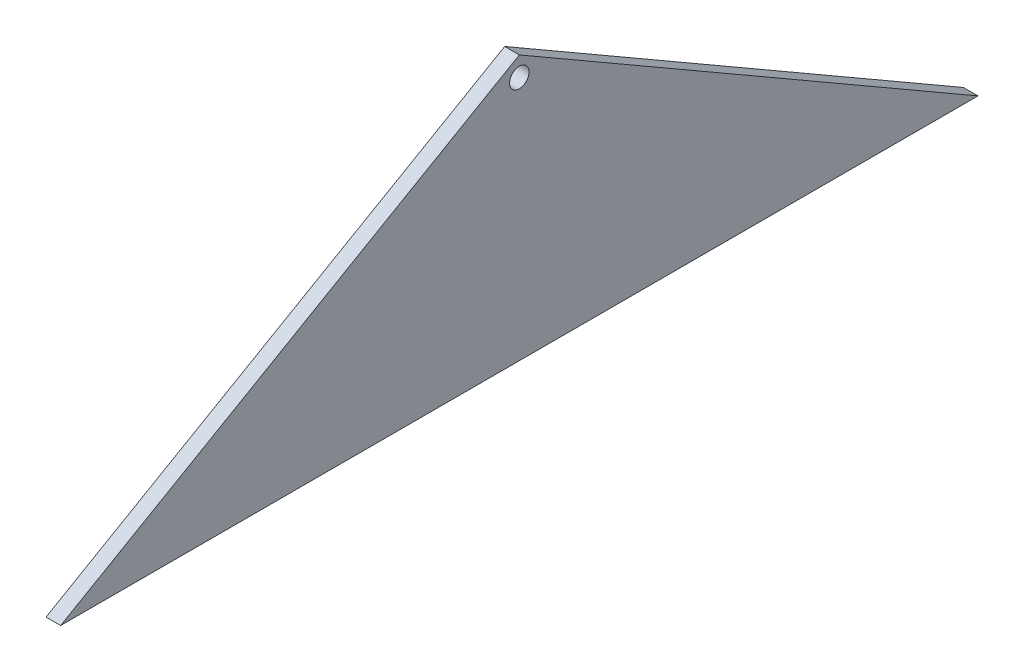
ISO-10303-21;
HEADER;
FILE_DESCRIPTION(('STEP AP214'),'2;1');
FILE_NAME('part.step','',(''),(''),'','','');
FILE_SCHEMA(('AUTOMOTIVE_DESIGN { 1 0 10303 214 1 1 1 1 }'));
ENDSEC;
DATA;
#1=APPLICATION_CONTEXT('core data for automotive mechanical design processes');
#2=APPLICATION_PROTOCOL_DEFINITION('international standard','automotive_design',2000,#1);
#3=PRODUCT_CONTEXT('',#1,'mechanical');
#4=PRODUCT('Part','Part','',(#3));
#5=PRODUCT_RELATED_PRODUCT_CATEGORY('part','',(#4));
#6=PRODUCT_DEFINITION_FORMATION('','',#4);
#7=PRODUCT_DEFINITION_CONTEXT('part definition',#1,'design');
#8=PRODUCT_DEFINITION('design','',#6,#7);
#9=PRODUCT_DEFINITION_SHAPE('','',#8);
#10=(LENGTH_UNIT() NAMED_UNIT(*) SI_UNIT(.MILLI.,.METRE.));
#11=(NAMED_UNIT(*) PLANE_ANGLE_UNIT() SI_UNIT($,.RADIAN.));
#12=(NAMED_UNIT(*) SI_UNIT($,.STERADIAN.) SOLID_ANGLE_UNIT());
#13=UNCERTAINTY_MEASURE_WITH_UNIT(LENGTH_MEASURE(1.E-05),#10,'distance_accuracy_value','');
#14=(GEOMETRIC_REPRESENTATION_CONTEXT(3) GLOBAL_UNCERTAINTY_ASSIGNED_CONTEXT((#13)) GLOBAL_UNIT_ASSIGNED_CONTEXT((#10,
#11,#12)) REPRESENTATION_CONTEXT('',''));
#15=CARTESIAN_POINT('',(0.,0.,0.));
#16=DIRECTION('',(0.,0.,1.));
#17=DIRECTION('',(1.,0.,0.));
#18=AXIS2_PLACEMENT_3D('',#15,#16,#17);
#19=CARTESIAN_POINT('',(3.,0.,0.));
#20=DIRECTION('',(1.,0.,0.));
#21=DIRECTION('',(0.,0.,-1.));
#22=AXIS2_PLACEMENT_3D('',#19,#20,#21);
#23=PLANE('',#22);
#24=DIRECTION('',(0.,0.500000000000001,0.866025403784438));
#25=VECTOR('',#24,1.);
#26=CARTESIAN_POINT('',(3.,54.270925303825,0.));
#27=LINE('',#26,#25);
#28=CARTESIAN_POINT('',(3.,0.,-94.));
#29=VERTEX_POINT('',#28);
#30=CARTESIAN_POINT('',(3.,54.270925303825,0.));
#31=VERTEX_POINT('',#30);
#32=EDGE_CURVE('E76',#29,#31,#27,.T.);
#33=ORIENTED_EDGE('',*,*,#32,.T.);
#34=DIRECTION('',(0.,-0.500000000000001,0.866025403784438));
#35=VECTOR('',#34,1.);
#36=CARTESIAN_POINT('',(3.,0.,94.));
#37=LINE('',#36,#35);
#38=CARTESIAN_POINT('',(3.,0.,94.));
#39=VERTEX_POINT('',#38);
#40=EDGE_CURVE('E72',#31,#39,#37,.T.);
#41=ORIENTED_EDGE('',*,*,#40,.T.);
#42=DIRECTION('',(0.,0.,-1.));
#43=VECTOR('',#42,1.);
#44=CARTESIAN_POINT('',(3.,0.,94.));
#45=LINE('',#44,#43);
#46=EDGE_CURVE('E52',#39,#29,#45,.T.);
#47=ORIENTED_EDGE('',*,*,#46,.T.);
#48=EDGE_LOOP('',(#33,#41,#47));
#49=FACE_BOUND('',#48,.T.);
#50=CARTESIAN_POINT('',(3.,50.270925303825,0.));
#51=DIRECTION('',(1.,0.,0.));
#52=DIRECTION('',(0.,0.,-1.));
#53=AXIS2_PLACEMENT_3D('',#50,#51,#52);
#54=CIRCLE('',#53,2.);
#55=CARTESIAN_POINT('',(3.,50.270925303825,-2.));
#56=VERTEX_POINT('',#55);
#57=EDGE_CURVE('E86',#56,#56,#54,.T.);
#58=ORIENTED_EDGE('',*,*,#57,.F.);
#59=EDGE_LOOP('',(#58));
#60=FACE_BOUND('',#59,.T.);
#61=ADVANCED_FACE('F35',(#49,#60),#23,.T.);
#62=CARTESIAN_POINT('',(0.,0.,0.));
#63=DIRECTION('',(1.,0.,0.));
#64=DIRECTION('',(0.,0.,-1.));
#65=AXIS2_PLACEMENT_3D('',#62,#63,#64);
#66=PLANE('',#65);
#67=DIRECTION('',(0.,0.500000000000001,0.866025403784438));
#68=VECTOR('',#67,1.);
#69=CARTESIAN_POINT('',(0.,54.270925303825,0.));
#70=LINE('',#69,#68);
#71=CARTESIAN_POINT('',(0.,0.,-94.));
#72=VERTEX_POINT('',#71);
#73=CARTESIAN_POINT('',(0.,54.270925303825,0.));
#74=VERTEX_POINT('',#73);
#75=EDGE_CURVE('E83',#72,#74,#70,.T.);
#76=ORIENTED_EDGE('',*,*,#75,.F.);
#77=DIRECTION('',(0.,0.,-1.));
#78=VECTOR('',#77,1.);
#79=CARTESIAN_POINT('',(0.,0.,94.));
#80=LINE('',#79,#78);
#81=CARTESIAN_POINT('',(0.,0.,94.));
#82=VERTEX_POINT('',#81);
#83=EDGE_CURVE('E69',#82,#72,#80,.T.);
#84=ORIENTED_EDGE('',*,*,#83,.F.);
#85=DIRECTION('',(0.,-0.500000000000001,0.866025403784438));
#86=VECTOR('',#85,1.);
#87=CARTESIAN_POINT('',(0.,0.,94.));
#88=LINE('',#87,#86);
#89=EDGE_CURVE('E64',#74,#82,#88,.T.);
#90=ORIENTED_EDGE('',*,*,#89,.F.);
#91=EDGE_LOOP('',(#76,#84,#90));
#92=FACE_BOUND('',#91,.T.);
#93=CARTESIAN_POINT('',(0.,50.270925303825,0.));
#94=DIRECTION('',(1.,0.,0.));
#95=DIRECTION('',(0.,0.,-1.));
#96=AXIS2_PLACEMENT_3D('',#93,#94,#95);
#97=CIRCLE('',#96,2.);
#98=CARTESIAN_POINT('',(0.,50.270925303825,-2.));
#99=VERTEX_POINT('',#98);
#100=EDGE_CURVE('E90',#99,#99,#97,.T.);
#101=ORIENTED_EDGE('',*,*,#100,.T.);
#102=EDGE_LOOP('',(#101));
#103=FACE_BOUND('',#102,.T.);
#104=ADVANCED_FACE('F96',(#92,#103),#66,.F.);
#105=CARTESIAN_POINT('',(3.,54.270925303825,0.));
#106=DIRECTION('',(0.,-0.866025403784438,0.500000000000001));
#107=DIRECTION('',(0.,-0.500000000000001,-0.866025403784438));
#108=AXIS2_PLACEMENT_3D('',#105,#106,#107);
#109=PLANE('',#108);
#110=ORIENTED_EDGE('',*,*,#75,.T.);
#111=DIRECTION('',(-1.,0.,0.));
#112=VECTOR('',#111,1.);
#113=CARTESIAN_POINT('',(3.,54.270925303825,0.));
#114=LINE('',#113,#112);
#115=EDGE_CURVE('E11',#31,#74,#114,.T.);
#116=ORIENTED_EDGE('',*,*,#115,.F.);
#117=ORIENTED_EDGE('',*,*,#32,.F.);
#118=DIRECTION('',(-1.,0.,0.));
#119=VECTOR('',#118,1.);
#120=CARTESIAN_POINT('',(3.,0.,-94.));
#121=LINE('',#120,#119);
#122=EDGE_CURVE('E84',#29,#72,#121,.T.);
#123=ORIENTED_EDGE('',*,*,#122,.T.);
#124=EDGE_LOOP('',(#110,#116,#117,#123));
#125=FACE_BOUND('',#124,.T.);
#126=ADVANCED_FACE('F37',(#125),#109,.F.);
#127=CARTESIAN_POINT('',(3.,0.,94.));
#128=DIRECTION('',(0.,-0.866025403784438,-0.500000000000001));
#129=DIRECTION('',(0.,0.500000000000001,-0.866025403784438));
#130=AXIS2_PLACEMENT_3D('',#127,#128,#129);
#131=PLANE('',#130);
#132=ORIENTED_EDGE('',*,*,#89,.T.);
#133=DIRECTION('',(-1.,0.,0.));
#134=VECTOR('',#133,1.);
#135=CARTESIAN_POINT('',(3.,0.,94.));
#136=LINE('',#135,#134);
#137=EDGE_CURVE('E44',#39,#82,#136,.T.);
#138=ORIENTED_EDGE('',*,*,#137,.F.);
#139=ORIENTED_EDGE('',*,*,#40,.F.);
#140=ORIENTED_EDGE('',*,*,#115,.T.);
#141=EDGE_LOOP('',(#132,#138,#139,#140));
#142=FACE_BOUND('',#141,.T.);
#143=ADVANCED_FACE('F73',(#142),#131,.F.);
#144=CARTESIAN_POINT('',(3.,0.,94.));
#145=DIRECTION('',(0.,1.,0.));
#146=DIRECTION('',(0.,0.,1.));
#147=AXIS2_PLACEMENT_3D('',#144,#145,#146);
#148=PLANE('',#147);
#149=ORIENTED_EDGE('',*,*,#83,.T.);
#150=ORIENTED_EDGE('',*,*,#122,.F.);
#151=ORIENTED_EDGE('',*,*,#46,.F.);
#152=ORIENTED_EDGE('',*,*,#137,.T.);
#153=EDGE_LOOP('',(#149,#150,#151,#152));
#154=FACE_BOUND('',#153,.T.);
#155=ADVANCED_FACE('F95',(#154),#148,.F.);
#156=CARTESIAN_POINT('',(3.,50.270925303825,0.));
#157=DIRECTION('',(-1.,0.,0.));
#158=DIRECTION('',(0.,0.,1.));
#159=AXIS2_PLACEMENT_3D('',#156,#157,#158);
#160=CYLINDRICAL_SURFACE('',#159,2.);
#161=ORIENTED_EDGE('',*,*,#57,.T.);
#162=EDGE_LOOP('',(#161));
#163=FACE_BOUND('',#162,.T.);
#164=ORIENTED_EDGE('',*,*,#100,.F.);
#165=EDGE_LOOP('',(#164));
#166=FACE_BOUND('',#165,.T.);
#167=ADVANCED_FACE('F104',(#163,#166),#160,.F.);
#168=CLOSED_SHELL('',(#61,#104,#126,#143,#155,#167));
#169=MANIFOLD_SOLID_BREP('B2',#168);
#170=ADVANCED_BREP_SHAPE_REPRESENTATION('',(#18,#169),#14);
#171=SHAPE_DEFINITION_REPRESENTATION(#9,#170);
ENDSEC;
END-ISO-10303-21;
